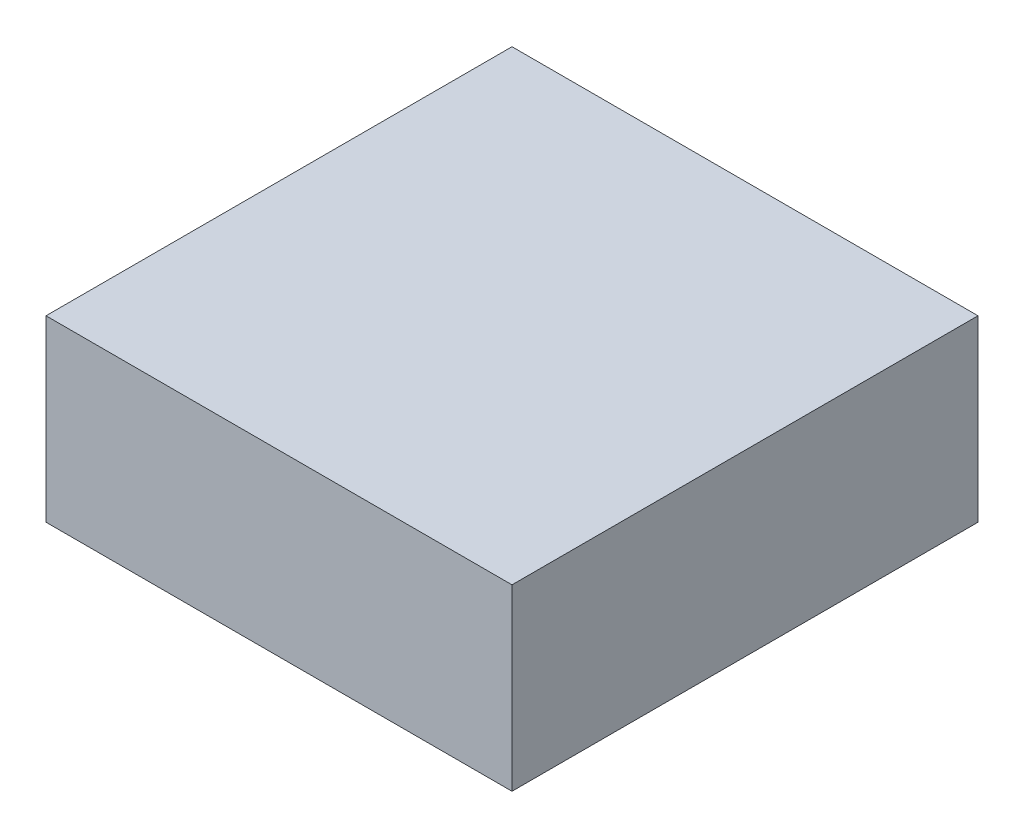
ISO-10303-21;
HEADER;
FILE_DESCRIPTION(('STEP AP214'),'2;1');
FILE_NAME('part.step','',(''),(''),'','','');
FILE_SCHEMA(('AUTOMOTIVE_DESIGN { 1 0 10303 214 1 1 1 1 }'));
ENDSEC;
DATA;
#1=APPLICATION_CONTEXT('core data for automotive mechanical design processes');
#2=APPLICATION_PROTOCOL_DEFINITION('international standard','automotive_design',2000,#1);
#3=PRODUCT_CONTEXT('',#1,'mechanical');
#4=PRODUCT('Part','Part','',(#3));
#5=PRODUCT_RELATED_PRODUCT_CATEGORY('part','',(#4));
#6=PRODUCT_DEFINITION_FORMATION('','',#4);
#7=PRODUCT_DEFINITION_CONTEXT('part definition',#1,'design');
#8=PRODUCT_DEFINITION('design','',#6,#7);
#9=PRODUCT_DEFINITION_SHAPE('','',#8);
#10=(LENGTH_UNIT() NAMED_UNIT(*) SI_UNIT(.MILLI.,.METRE.));
#11=(NAMED_UNIT(*) PLANE_ANGLE_UNIT() SI_UNIT($,.RADIAN.));
#12=(NAMED_UNIT(*) SI_UNIT($,.STERADIAN.) SOLID_ANGLE_UNIT());
#13=UNCERTAINTY_MEASURE_WITH_UNIT(LENGTH_MEASURE(1.E-05),#10,'distance_accuracy_value','');
#14=(GEOMETRIC_REPRESENTATION_CONTEXT(3) GLOBAL_UNCERTAINTY_ASSIGNED_CONTEXT((#13)) GLOBAL_UNIT_ASSIGNED_CONTEXT((#10,
#11,#12)) REPRESENTATION_CONTEXT('',''));
#15=CARTESIAN_POINT('',(0.,0.,0.));
#16=DIRECTION('',(0.,0.,1.));
#17=DIRECTION('',(1.,0.,0.));
#18=AXIS2_PLACEMENT_3D('',#15,#16,#17);
#19=CARTESIAN_POINT('',(-2750.,2000.,0.));
#20=DIRECTION('',(0.,-1.,0.));
#21=DIRECTION('',(0.,0.,-1.));
#22=AXIS2_PLACEMENT_3D('',#19,#20,#21);
#23=PLANE('',#22);
#24=CARTESIAN_POINT('',(0.,2000.,0.));
#25=DIRECTION('',(0.,1.,0.));
#26=DIRECTION('',(0.,0.,1.));
#27=AXIS2_PLACEMENT_3D('',#24,#25,#26);
#28=CIRCLE('',#27,2750.);
#29=CARTESIAN_POINT('',(0.,2000.,2750.));
#30=VERTEX_POINT('',#29);
#31=EDGE_CURVE('E102',#30,#30,#28,.T.);
#32=ORIENTED_EDGE('',*,*,#31,.T.);
#33=EDGE_LOOP('',(#32));
#34=FACE_BOUND('',#33,.T.);
#35=CARTESIAN_POINT('',(0.,2000.,0.));
#36=DIRECTION('',(0.,-1.,0.));
#37=DIRECTION('',(0.,0.,-1.));
#38=AXIS2_PLACEMENT_3D('',#35,#36,#37);
#39=CIRCLE('',#38,5000.);
#40=CARTESIAN_POINT('',(0.,2000.,-5000.));
#41=VERTEX_POINT('',#40);
#42=EDGE_CURVE('E12',#41,#41,#39,.F.);
#43=ORIENTED_EDGE('',*,*,#42,.F.);
#44=EDGE_LOOP('',(#43));
#45=FACE_BOUND('',#44,.T.);
#46=ADVANCED_FACE('F93',(#34,#45),#23,.T.);
#47=CARTESIAN_POINT('',(0.,3520.44,0.));
#48=DIRECTION('',(0.,1.,0.));
#49=DIRECTION('',(0.,0.,1.));
#50=AXIS2_PLACEMENT_3D('',#47,#48,#49);
#51=CYLINDRICAL_SURFACE('',#50,2750.);
#52=CARTESIAN_POINT('',(0.,2732.37406594724,0.));
#53=DIRECTION('',(0.,1.,0.));
#54=DIRECTION('',(0.,0.,1.));
#55=AXIS2_PLACEMENT_3D('',#52,#53,#54);
#56=CIRCLE('',#55,2750.);
#57=CARTESIAN_POINT('',(0.,2732.37406594724,2750.));
#58=VERTEX_POINT('',#57);
#59=EDGE_CURVE('E187',#58,#58,#56,.T.);
#60=ORIENTED_EDGE('',*,*,#59,.T.);
#61=EDGE_LOOP('',(#60));
#62=FACE_BOUND('',#61,.T.);
#63=ORIENTED_EDGE('',*,*,#31,.F.);
#64=EDGE_LOOP('',(#63));
#65=FACE_BOUND('',#64,.T.);
#66=ADVANCED_FACE('F95',(#62,#65),#51,.F.);
#67=CARTESIAN_POINT('',(-2123.38131869504,3332.,0.));
#68=DIRECTION('',(0.,-1.,0.));
#69=DIRECTION('',(0.,0.,-1.));
#70=AXIS2_PLACEMENT_3D('',#67,#68,#69);
#71=PLANE('',#70);
#72=CARTESIAN_POINT('',(0.,3332.,0.));
#73=DIRECTION('',(0.,1.,0.));
#74=DIRECTION('',(0.,0.,1.));
#75=AXIS2_PLACEMENT_3D('',#72,#73,#74);
#76=CIRCLE('',#75,2123.38131869504);
#77=CARTESIAN_POINT('',(0.,3332.,2123.38131869504));
#78=VERTEX_POINT('',#77);
#79=EDGE_CURVE('E191',#78,#78,#76,.T.);
#80=ORIENTED_EDGE('',*,*,#79,.F.);
#81=EDGE_LOOP('',(#80));
#82=FACE_BOUND('',#81,.T.);
#83=ADVANCED_FACE('F201',(#82),#71,.T.);
#84=CARTESIAN_POINT('',(0.,2732.37406594724,0.));
#85=DIRECTION('',(0.,-1.,0.));
#86=DIRECTION('',(0.,0.,-1.));
#87=AXIS2_PLACEMENT_3D('',#84,#85,#86);
#88=CONICAL_SURFACE('',#87,2750.,0.807407139738015);
#89=ORIENTED_EDGE('',*,*,#79,.T.);
#90=EDGE_LOOP('',(#89));
#91=FACE_BOUND('',#90,.T.);
#92=ORIENTED_EDGE('',*,*,#59,.F.);
#93=EDGE_LOOP('',(#92));
#94=FACE_BOUND('',#93,.T.);
#95=ADVANCED_FACE('F206',(#91,#94),#88,.F.);
#96=CARTESIAN_POINT('',(0.,-2000.,0.));
#97=DIRECTION('',(0.,-1.,0.));
#98=DIRECTION('',(0.,0.,-1.));
#99=AXIS2_PLACEMENT_3D('',#96,#97,#98);
#100=PLANE('',#99);
#101=DIRECTION('',(0.,0.,-1.));
#102=VECTOR('',#101,1.);
#103=CARTESIAN_POINT('',(-7000.,-2000.,7000.));
#104=LINE('',#103,#102);
#105=CARTESIAN_POINT('',(-7000.,-2000.,7000.));
#106=VERTEX_POINT('',#105);
#107=CARTESIAN_POINT('',(-7000.,-2000.,-7000.));
#108=VERTEX_POINT('',#107);
#109=EDGE_CURVE('E135',#106,#108,#104,.T.);
#110=ORIENTED_EDGE('',*,*,#109,.T.);
#111=DIRECTION('',(1.,0.,0.));
#112=VECTOR('',#111,1.);
#113=CARTESIAN_POINT('',(-7000.,-2000.,-7000.));
#114=LINE('',#113,#112);
#115=CARTESIAN_POINT('',(7000.,-2000.,-7000.));
#116=VERTEX_POINT('',#115);
#117=EDGE_CURVE('E143',#108,#116,#114,.T.);
#118=ORIENTED_EDGE('',*,*,#117,.T.);
#119=DIRECTION('',(0.,0.,1.));
#120=VECTOR('',#119,1.);
#121=CARTESIAN_POINT('',(7000.,-2000.,7000.));
#122=LINE('',#121,#120);
#123=CARTESIAN_POINT('',(7000.,-2000.,7000.));
#124=VERTEX_POINT('',#123);
#125=EDGE_CURVE('E151',#116,#124,#122,.T.);
#126=ORIENTED_EDGE('',*,*,#125,.T.);
#127=DIRECTION('',(-1.,0.,0.));
#128=VECTOR('',#127,1.);
#129=CARTESIAN_POINT('',(-7000.,-2000.,7000.));
#130=LINE('',#129,#128);
#131=EDGE_CURVE('E157',#124,#106,#130,.T.);
#132=ORIENTED_EDGE('',*,*,#131,.T.);
#133=EDGE_LOOP('',(#110,#118,#126,#132));
#134=FACE_BOUND('',#133,.T.);
#135=CARTESIAN_POINT('',(0.,-2000.,0.));
#136=DIRECTION('',(0.,-1.,0.));
#137=DIRECTION('',(0.,0.,-1.));
#138=AXIS2_PLACEMENT_3D('',#135,#136,#137);
#139=CIRCLE('',#138,5000.);
#140=CARTESIAN_POINT('',(0.,-2000.,-5000.));
#141=VERTEX_POINT('',#140);
#142=EDGE_CURVE('E159',#141,#141,#139,.T.);
#143=ORIENTED_EDGE('',*,*,#142,.F.);
#144=EDGE_LOOP('',(#143));
#145=FACE_BOUND('',#144,.T.);
#146=ADVANCED_FACE('F154',(#134,#145),#100,.T.);
#147=CARTESIAN_POINT('',(0.,-2000.,0.));
#148=DIRECTION('',(0.,1.,0.));
#149=DIRECTION('',(0.,0.,1.));
#150=AXIS2_PLACEMENT_3D('',#147,#148,#149);
#151=CYLINDRICAL_SURFACE('',#150,5000.);
#152=ORIENTED_EDGE('',*,*,#142,.T.);
#153=EDGE_LOOP('',(#152));
#154=FACE_BOUND('',#153,.T.);
#155=ORIENTED_EDGE('',*,*,#42,.T.);
#156=EDGE_LOOP('',(#155));
#157=FACE_BOUND('',#156,.T.);
#158=ADVANCED_FACE('F219',(#154,#157),#151,.F.);
#159=CARTESIAN_POINT('',(0.,3372.,0.));
#160=DIRECTION('',(0.,1.,0.));
#161=DIRECTION('',(0.,0.,1.));
#162=AXIS2_PLACEMENT_3D('',#159,#160,#161);
#163=PLANE('',#162);
#164=DIRECTION('',(1.,0.,0.));
#165=VECTOR('',#164,1.);
#166=CARTESIAN_POINT('',(0.,3372.,7000.));
#167=LINE('',#166,#165);
#168=CARTESIAN_POINT('',(-7000.,3372.,7000.));
#169=VERTEX_POINT('',#168);
#170=CARTESIAN_POINT('',(7000.,3372.,7000.));
#171=VERTEX_POINT('',#170);
#172=EDGE_CURVE('E180',#169,#171,#167,.T.);
#173=ORIENTED_EDGE('',*,*,#172,.T.);
#174=DIRECTION('',(0.,0.,1.));
#175=VECTOR('',#174,1.);
#176=CARTESIAN_POINT('',(7000.,3372.,0.));
#177=LINE('',#176,#175);
#178=CARTESIAN_POINT('',(7000.,3372.,-7000.));
#179=VERTEX_POINT('',#178);
#180=EDGE_CURVE('E140',#179,#171,#177,.T.);
#181=ORIENTED_EDGE('',*,*,#180,.F.);
#182=DIRECTION('',(1.,0.,0.));
#183=VECTOR('',#182,1.);
#184=CARTESIAN_POINT('',(0.,3372.,-7000.));
#185=LINE('',#184,#183);
#186=CARTESIAN_POINT('',(-7000.,3372.,-7000.));
#187=VERTEX_POINT('',#186);
#188=EDGE_CURVE('E139',#187,#179,#185,.T.);
#189=ORIENTED_EDGE('',*,*,#188,.F.);
#190=DIRECTION('',(0.,0.,1.));
#191=VECTOR('',#190,1.);
#192=CARTESIAN_POINT('',(-7000.,3372.,4.44089209850063E-13));
#193=LINE('',#192,#191);
#194=EDGE_CURVE('E114',#187,#169,#193,.T.);
#195=ORIENTED_EDGE('',*,*,#194,.T.);
#196=EDGE_LOOP('',(#173,#181,#189,#195));
#197=FACE_BOUND('',#196,.T.);
#198=ADVANCED_FACE('F225',(#197),#163,.T.);
#199=CARTESIAN_POINT('',(7000.,-7899.49493661167,0.));
#200=DIRECTION('',(-1.,0.,0.));
#201=DIRECTION('',(0.,0.,1.));
#202=AXIS2_PLACEMENT_3D('',#199,#200,#201);
#203=PLANE('',#202);
#204=DIRECTION('',(0.,1.,0.));
#205=VECTOR('',#204,1.);
#206=CARTESIAN_POINT('',(7000.,-7899.49493661167,7000.));
#207=LINE('',#206,#205);
#208=EDGE_CURVE('E169',#124,#171,#207,.T.);
#209=ORIENTED_EDGE('',*,*,#208,.F.);
#210=ORIENTED_EDGE('',*,*,#125,.F.);
#211=DIRECTION('',(0.,1.,0.));
#212=VECTOR('',#211,1.);
#213=CARTESIAN_POINT('',(7000.,-7899.49493661167,-7000.));
#214=LINE('',#213,#212);
#215=EDGE_CURVE('E146',#116,#179,#214,.T.);
#216=ORIENTED_EDGE('',*,*,#215,.T.);
#217=ORIENTED_EDGE('',*,*,#180,.T.);
#218=EDGE_LOOP('',(#209,#210,#216,#217));
#219=FACE_BOUND('',#218,.T.);
#220=ADVANCED_FACE('F226',(#219),#203,.F.);
#221=CARTESIAN_POINT('',(0.,-7899.49493661167,-7000.));
#222=DIRECTION('',(0.,0.,1.));
#223=DIRECTION('',(1.,0.,0.));
#224=AXIS2_PLACEMENT_3D('',#221,#222,#223);
#225=PLANE('',#224);
#226=ORIENTED_EDGE('',*,*,#215,.F.);
#227=ORIENTED_EDGE('',*,*,#117,.F.);
#228=DIRECTION('',(0.,1.,0.));
#229=VECTOR('',#228,1.);
#230=CARTESIAN_POINT('',(-7000.,-7899.49493661167,-7000.));
#231=LINE('',#230,#229);
#232=EDGE_CURVE('E131',#108,#187,#231,.T.);
#233=ORIENTED_EDGE('',*,*,#232,.T.);
#234=ORIENTED_EDGE('',*,*,#188,.T.);
#235=EDGE_LOOP('',(#226,#227,#233,#234));
#236=FACE_BOUND('',#235,.T.);
#237=ADVANCED_FACE('F144',(#236),#225,.F.);
#238=CARTESIAN_POINT('',(-7000.,-7899.49493661167,4.44089209850063E-13));
#239=DIRECTION('',(-1.,0.,0.));
#240=DIRECTION('',(0.,0.,1.));
#241=AXIS2_PLACEMENT_3D('',#238,#239,#240);
#242=PLANE('',#241);
#243=ORIENTED_EDGE('',*,*,#194,.F.);
#244=ORIENTED_EDGE('',*,*,#232,.F.);
#245=ORIENTED_EDGE('',*,*,#109,.F.);
#246=DIRECTION('',(0.,1.,0.));
#247=VECTOR('',#246,1.);
#248=CARTESIAN_POINT('',(-7000.,-7899.49493661167,7000.));
#249=LINE('',#248,#247);
#250=EDGE_CURVE('E109',#106,#169,#249,.T.);
#251=ORIENTED_EDGE('',*,*,#250,.T.);
#252=EDGE_LOOP('',(#243,#244,#245,#251));
#253=FACE_BOUND('',#252,.T.);
#254=ADVANCED_FACE('F133',(#253),#242,.T.);
#255=CARTESIAN_POINT('',(0.,-7899.49493661167,7000.));
#256=DIRECTION('',(0.,0.,1.));
#257=DIRECTION('',(1.,0.,0.));
#258=AXIS2_PLACEMENT_3D('',#255,#256,#257);
#259=PLANE('',#258);
#260=ORIENTED_EDGE('',*,*,#250,.F.);
#261=ORIENTED_EDGE('',*,*,#131,.F.);
#262=ORIENTED_EDGE('',*,*,#208,.T.);
#263=ORIENTED_EDGE('',*,*,#172,.F.);
#264=EDGE_LOOP('',(#260,#261,#262,#263));
#265=FACE_BOUND('',#264,.T.);
#266=ADVANCED_FACE('F222',(#265),#259,.T.);
#267=CLOSED_SHELL('',(#46,#66,#83,#95,#146,#158,#198,#220,#237,#254,#266));
#268=MANIFOLD_SOLID_BREP('B2',#267);
#269=ADVANCED_BREP_SHAPE_REPRESENTATION('',(#18,#268),#14);
#270=SHAPE_DEFINITION_REPRESENTATION(#9,#269);
ENDSEC;
END-ISO-10303-21;
